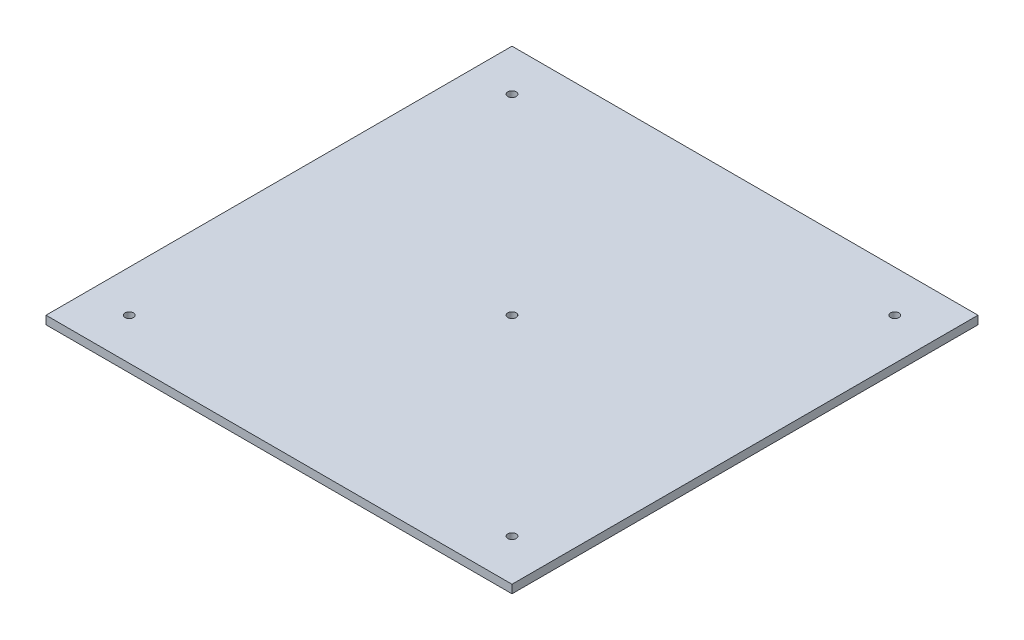
ISO-10303-21;
HEADER;
FILE_DESCRIPTION(('STEP AP214'),'2;1');
FILE_NAME('part.step','',(''),(''),'','','');
FILE_SCHEMA(('AUTOMOTIVE_DESIGN { 1 0 10303 214 1 1 1 1 }'));
ENDSEC;
DATA;
#1=APPLICATION_CONTEXT('core data for automotive mechanical design processes');
#2=APPLICATION_PROTOCOL_DEFINITION('international standard','automotive_design',2000,#1);
#3=PRODUCT_CONTEXT('',#1,'mechanical');
#4=PRODUCT('Part','Part','',(#3));
#5=PRODUCT_RELATED_PRODUCT_CATEGORY('part','',(#4));
#6=PRODUCT_DEFINITION_FORMATION('','',#4);
#7=PRODUCT_DEFINITION_CONTEXT('part definition',#1,'design');
#8=PRODUCT_DEFINITION('design','',#6,#7);
#9=PRODUCT_DEFINITION_SHAPE('','',#8);
#10=(LENGTH_UNIT() NAMED_UNIT(*) SI_UNIT(.MILLI.,.METRE.));
#11=(NAMED_UNIT(*) PLANE_ANGLE_UNIT() SI_UNIT($,.RADIAN.));
#12=(NAMED_UNIT(*) SI_UNIT($,.STERADIAN.) SOLID_ANGLE_UNIT());
#13=UNCERTAINTY_MEASURE_WITH_UNIT(LENGTH_MEASURE(1.E-05),#10,'distance_accuracy_value','');
#14=(GEOMETRIC_REPRESENTATION_CONTEXT(3) GLOBAL_UNCERTAINTY_ASSIGNED_CONTEXT((#13)) GLOBAL_UNIT_ASSIGNED_CONTEXT((#10,
#11,#12)) REPRESENTATION_CONTEXT('',''));
#15=CARTESIAN_POINT('',(0.,0.,0.));
#16=DIRECTION('',(0.,0.,1.));
#17=DIRECTION('',(1.,0.,0.));
#18=AXIS2_PLACEMENT_3D('',#15,#16,#17);
#19=CARTESIAN_POINT('',(0.,2.,0.));
#20=DIRECTION('',(0.,1.,0.));
#21=DIRECTION('',(0.,0.,1.));
#22=AXIS2_PLACEMENT_3D('',#19,#20,#21);
#23=PLANE('',#22);
#24=CARTESIAN_POINT('',(46.,2.,-46.));
#25=DIRECTION('',(0.,1.,0.));
#26=DIRECTION('',(0.,0.,-1.));
#27=AXIS2_PLACEMENT_3D('',#24,#25,#26);
#28=CIRCLE('',#27,0.999999999999998);
#29=CARTESIAN_POINT('',(46.,2.,-47.));
#30=VERTEX_POINT('',#29);
#31=EDGE_CURVE('E167',#30,#30,#28,.T.);
#32=ORIENTED_EDGE('',*,*,#31,.F.);
#33=EDGE_LOOP('',(#32));
#34=FACE_BOUND('',#33,.T.);
#35=CARTESIAN_POINT('',(-46.,2.,-46.));
#36=DIRECTION('',(0.,-1.,0.));
#37=DIRECTION('',(0.,0.,-1.));
#38=AXIS2_PLACEMENT_3D('',#35,#36,#37);
#39=CIRCLE('',#38,0.999999999999998);
#40=CARTESIAN_POINT('',(-46.,2.,-47.));
#41=VERTEX_POINT('',#40);
#42=EDGE_CURVE('E151',#41,#41,#39,.T.);
#43=ORIENTED_EDGE('',*,*,#42,.T.);
#44=EDGE_LOOP('',(#43));
#45=FACE_BOUND('',#44,.T.);
#46=CARTESIAN_POINT('',(-46.,2.,46.));
#47=DIRECTION('',(0.,1.,0.));
#48=DIRECTION('',(0.,0.,1.));
#49=AXIS2_PLACEMENT_3D('',#46,#47,#48);
#50=CIRCLE('',#49,0.999999999999998);
#51=CARTESIAN_POINT('',(-46.,2.,47.));
#52=VERTEX_POINT('',#51);
#53=EDGE_CURVE('E144',#52,#52,#50,.T.);
#54=ORIENTED_EDGE('',*,*,#53,.F.);
#55=EDGE_LOOP('',(#54));
#56=FACE_BOUND('',#55,.T.);
#57=CARTESIAN_POINT('',(0.,2.,0.));
#58=DIRECTION('',(0.,1.,0.));
#59=DIRECTION('',(0.,0.,1.));
#60=AXIS2_PLACEMENT_3D('',#57,#58,#59);
#61=CIRCLE('',#60,1.);
#62=CARTESIAN_POINT('',(0.,2.,1.));
#63=VERTEX_POINT('',#62);
#64=EDGE_CURVE('E139',#63,#63,#61,.T.);
#65=ORIENTED_EDGE('',*,*,#64,.F.);
#66=EDGE_LOOP('',(#65));
#67=FACE_BOUND('',#66,.T.);
#68=DIRECTION('',(0.,0.,1.));
#69=VECTOR('',#68,1.);
#70=CARTESIAN_POINT('',(-56.,2.,-56.));
#71=LINE('',#70,#69);
#72=CARTESIAN_POINT('',(-56.,2.,-56.));
#73=VERTEX_POINT('',#72);
#74=CARTESIAN_POINT('',(-56.,2.,56.));
#75=VERTEX_POINT('',#74);
#76=EDGE_CURVE('E97',#73,#75,#71,.T.);
#77=ORIENTED_EDGE('',*,*,#76,.T.);
#78=DIRECTION('',(1.,0.,0.));
#79=VECTOR('',#78,1.);
#80=CARTESIAN_POINT('',(-56.,2.,56.));
#81=LINE('',#80,#79);
#82=CARTESIAN_POINT('',(56.,2.,56.));
#83=VERTEX_POINT('',#82);
#84=EDGE_CURVE('E92',#75,#83,#81,.T.);
#85=ORIENTED_EDGE('',*,*,#84,.T.);
#86=DIRECTION('',(0.,0.,-1.));
#87=VECTOR('',#86,1.);
#88=CARTESIAN_POINT('',(56.,2.,-56.));
#89=LINE('',#88,#87);
#90=CARTESIAN_POINT('',(56.,2.,-56.));
#91=VERTEX_POINT('',#90);
#92=EDGE_CURVE('E95',#83,#91,#89,.T.);
#93=ORIENTED_EDGE('',*,*,#92,.T.);
#94=DIRECTION('',(-1.,0.,0.));
#95=VECTOR('',#94,1.);
#96=CARTESIAN_POINT('',(-56.,2.,-56.));
#97=LINE('',#96,#95);
#98=EDGE_CURVE('E62',#91,#73,#97,.T.);
#99=ORIENTED_EDGE('',*,*,#98,.T.);
#100=EDGE_LOOP('',(#77,#85,#93,#99));
#101=FACE_BOUND('',#100,.T.);
#102=CARTESIAN_POINT('',(46.,2.,46.));
#103=DIRECTION('',(0.,-1.,0.));
#104=DIRECTION('',(0.,0.,1.));
#105=AXIS2_PLACEMENT_3D('',#102,#103,#104);
#106=CIRCLE('',#105,0.999999999999998);
#107=CARTESIAN_POINT('',(46.,2.,47.));
#108=VERTEX_POINT('',#107);
#109=EDGE_CURVE('E159',#108,#108,#106,.T.);
#110=ORIENTED_EDGE('',*,*,#109,.T.);
#111=EDGE_LOOP('',(#110));
#112=FACE_BOUND('',#111,.T.);
#113=ADVANCED_FACE('F44',(#34,#45,#56,#67,#101,#112),#23,.T.);
#114=CARTESIAN_POINT('',(0.,0.,0.));
#115=DIRECTION('',(0.,1.,0.));
#116=DIRECTION('',(0.,0.,1.));
#117=AXIS2_PLACEMENT_3D('',#114,#115,#116);
#118=PLANE('',#117);
#119=CARTESIAN_POINT('',(46.,0.,-46.));
#120=DIRECTION('',(0.,1.,0.));
#121=DIRECTION('',(0.,0.,-1.));
#122=AXIS2_PLACEMENT_3D('',#119,#120,#121);
#123=CIRCLE('',#122,0.999999999999998);
#124=CARTESIAN_POINT('',(46.,0.,-47.));
#125=VERTEX_POINT('',#124);
#126=EDGE_CURVE('E163',#125,#125,#123,.T.);
#127=ORIENTED_EDGE('',*,*,#126,.T.);
#128=EDGE_LOOP('',(#127));
#129=FACE_BOUND('',#128,.T.);
#130=CARTESIAN_POINT('',(-46.,0.,46.));
#131=DIRECTION('',(0.,1.,0.));
#132=DIRECTION('',(0.,0.,1.));
#133=AXIS2_PLACEMENT_3D('',#130,#131,#132);
#134=CIRCLE('',#133,0.999999999999998);
#135=CARTESIAN_POINT('',(-46.,0.,47.));
#136=VERTEX_POINT('',#135);
#137=EDGE_CURVE('E117',#136,#136,#134,.T.);
#138=ORIENTED_EDGE('',*,*,#137,.T.);
#139=EDGE_LOOP('',(#138));
#140=FACE_BOUND('',#139,.T.);
#141=CARTESIAN_POINT('',(0.,0.,0.));
#142=DIRECTION('',(0.,1.,0.));
#143=DIRECTION('',(0.,0.,1.));
#144=AXIS2_PLACEMENT_3D('',#141,#142,#143);
#145=CIRCLE('',#144,1.);
#146=CARTESIAN_POINT('',(0.,0.,1.));
#147=VERTEX_POINT('',#146);
#148=EDGE_CURVE('E135',#147,#147,#145,.T.);
#149=ORIENTED_EDGE('',*,*,#148,.T.);
#150=EDGE_LOOP('',(#149));
#151=FACE_BOUND('',#150,.T.);
#152=DIRECTION('',(0.,0.,1.));
#153=VECTOR('',#152,1.);
#154=CARTESIAN_POINT('',(-56.,0.,-56.));
#155=LINE('',#154,#153);
#156=CARTESIAN_POINT('',(-56.,0.,-56.));
#157=VERTEX_POINT('',#156);
#158=CARTESIAN_POINT('',(-56.,0.,56.));
#159=VERTEX_POINT('',#158);
#160=EDGE_CURVE('E113',#157,#159,#155,.T.);
#161=ORIENTED_EDGE('',*,*,#160,.F.);
#162=DIRECTION('',(-1.,0.,0.));
#163=VECTOR('',#162,1.);
#164=CARTESIAN_POINT('',(-56.,0.,-56.));
#165=LINE('',#164,#163);
#166=CARTESIAN_POINT('',(56.,0.,-56.));
#167=VERTEX_POINT('',#166);
#168=EDGE_CURVE('E85',#167,#157,#165,.T.);
#169=ORIENTED_EDGE('',*,*,#168,.F.);
#170=DIRECTION('',(0.,0.,-1.));
#171=VECTOR('',#170,1.);
#172=CARTESIAN_POINT('',(56.,0.,-56.));
#173=LINE('',#172,#171);
#174=CARTESIAN_POINT('',(56.,0.,56.));
#175=VERTEX_POINT('',#174);
#176=EDGE_CURVE('E79',#175,#167,#173,.T.);
#177=ORIENTED_EDGE('',*,*,#176,.F.);
#178=DIRECTION('',(1.,0.,0.));
#179=VECTOR('',#178,1.);
#180=CARTESIAN_POINT('',(-56.,0.,56.));
#181=LINE('',#180,#179);
#182=EDGE_CURVE('E102',#159,#175,#181,.T.);
#183=ORIENTED_EDGE('',*,*,#182,.F.);
#184=EDGE_LOOP('',(#161,#169,#177,#183));
#185=FACE_BOUND('',#184,.T.);
#186=CARTESIAN_POINT('',(-46.,0.,-46.));
#187=DIRECTION('',(0.,-1.,0.));
#188=DIRECTION('',(0.,0.,-1.));
#189=AXIS2_PLACEMENT_3D('',#186,#187,#188);
#190=CIRCLE('',#189,0.999999999999998);
#191=CARTESIAN_POINT('',(-46.,0.,-47.));
#192=VERTEX_POINT('',#191);
#193=EDGE_CURVE('E140',#192,#192,#190,.T.);
#194=ORIENTED_EDGE('',*,*,#193,.F.);
#195=EDGE_LOOP('',(#194));
#196=FACE_BOUND('',#195,.T.);
#197=CARTESIAN_POINT('',(46.,0.,46.));
#198=DIRECTION('',(0.,-1.,0.));
#199=DIRECTION('',(0.,0.,1.));
#200=AXIS2_PLACEMENT_3D('',#197,#198,#199);
#201=CIRCLE('',#200,0.999999999999998);
#202=CARTESIAN_POINT('',(46.,0.,47.));
#203=VERTEX_POINT('',#202);
#204=EDGE_CURVE('E155',#203,#203,#201,.T.);
#205=ORIENTED_EDGE('',*,*,#204,.F.);
#206=EDGE_LOOP('',(#205));
#207=FACE_BOUND('',#206,.T.);
#208=ADVANCED_FACE('F130',(#129,#140,#151,#185,#196,#207),#118,.F.);
#209=CARTESIAN_POINT('',(-56.,2.,-56.));
#210=DIRECTION('',(1.,0.,0.));
#211=DIRECTION('',(0.,0.,-1.));
#212=AXIS2_PLACEMENT_3D('',#209,#210,#211);
#213=PLANE('',#212);
#214=ORIENTED_EDGE('',*,*,#160,.T.);
#215=DIRECTION('',(0.,-1.,0.));
#216=VECTOR('',#215,1.);
#217=CARTESIAN_POINT('',(-56.,2.,56.));
#218=LINE('',#217,#216);
#219=EDGE_CURVE('E11',#75,#159,#218,.T.);
#220=ORIENTED_EDGE('',*,*,#219,.F.);
#221=ORIENTED_EDGE('',*,*,#76,.F.);
#222=DIRECTION('',(0.,-1.,0.));
#223=VECTOR('',#222,1.);
#224=CARTESIAN_POINT('',(-56.,2.,-56.));
#225=LINE('',#224,#223);
#226=EDGE_CURVE('E109',#73,#157,#225,.T.);
#227=ORIENTED_EDGE('',*,*,#226,.T.);
#228=EDGE_LOOP('',(#214,#220,#221,#227));
#229=FACE_BOUND('',#228,.T.);
#230=ADVANCED_FACE('F46',(#229),#213,.F.);
#231=CARTESIAN_POINT('',(-56.,2.,56.));
#232=DIRECTION('',(0.,0.,-1.));
#233=DIRECTION('',(-1.,0.,0.));
#234=AXIS2_PLACEMENT_3D('',#231,#232,#233);
#235=PLANE('',#234);
#236=ORIENTED_EDGE('',*,*,#182,.T.);
#237=DIRECTION('',(0.,-1.,0.));
#238=VECTOR('',#237,1.);
#239=CARTESIAN_POINT('',(56.,2.,56.));
#240=LINE('',#239,#238);
#241=EDGE_CURVE('E54',#83,#175,#240,.T.);
#242=ORIENTED_EDGE('',*,*,#241,.F.);
#243=ORIENTED_EDGE('',*,*,#84,.F.);
#244=ORIENTED_EDGE('',*,*,#219,.T.);
#245=EDGE_LOOP('',(#236,#242,#243,#244));
#246=FACE_BOUND('',#245,.T.);
#247=ADVANCED_FACE('F101',(#246),#235,.F.);
#248=CARTESIAN_POINT('',(56.,2.,-56.));
#249=DIRECTION('',(-1.,0.,0.));
#250=DIRECTION('',(0.,0.,1.));
#251=AXIS2_PLACEMENT_3D('',#248,#249,#250);
#252=PLANE('',#251);
#253=ORIENTED_EDGE('',*,*,#176,.T.);
#254=DIRECTION('',(0.,-1.,0.));
#255=VECTOR('',#254,1.);
#256=CARTESIAN_POINT('',(56.,2.,-56.));
#257=LINE('',#256,#255);
#258=EDGE_CURVE('E104',#91,#167,#257,.T.);
#259=ORIENTED_EDGE('',*,*,#258,.F.);
#260=ORIENTED_EDGE('',*,*,#92,.F.);
#261=ORIENTED_EDGE('',*,*,#241,.T.);
#262=EDGE_LOOP('',(#253,#259,#260,#261));
#263=FACE_BOUND('',#262,.T.);
#264=ADVANCED_FACE('F105',(#263),#252,.F.);
#265=CARTESIAN_POINT('',(-56.,2.,-56.));
#266=DIRECTION('',(0.,0.,1.));
#267=DIRECTION('',(1.,0.,0.));
#268=AXIS2_PLACEMENT_3D('',#265,#266,#267);
#269=PLANE('',#268);
#270=ORIENTED_EDGE('',*,*,#168,.T.);
#271=ORIENTED_EDGE('',*,*,#226,.F.);
#272=ORIENTED_EDGE('',*,*,#98,.F.);
#273=ORIENTED_EDGE('',*,*,#258,.T.);
#274=EDGE_LOOP('',(#270,#271,#272,#273));
#275=FACE_BOUND('',#274,.T.);
#276=ADVANCED_FACE('F127',(#275),#269,.F.);
#277=CARTESIAN_POINT('',(0.,0.,0.));
#278=DIRECTION('',(0.,1.,0.));
#279=DIRECTION('',(0.,0.,1.));
#280=AXIS2_PLACEMENT_3D('',#277,#278,#279);
#281=CYLINDRICAL_SURFACE('',#280,1.);
#282=ORIENTED_EDGE('',*,*,#148,.F.);
#283=EDGE_LOOP('',(#282));
#284=FACE_BOUND('',#283,.T.);
#285=ORIENTED_EDGE('',*,*,#64,.T.);
#286=EDGE_LOOP('',(#285));
#287=FACE_BOUND('',#286,.T.);
#288=ADVANCED_FACE('F193',(#284,#287),#281,.F.);
#289=CARTESIAN_POINT('',(-46.,0.,46.));
#290=DIRECTION('',(0.,1.,0.));
#291=DIRECTION('',(0.,0.,1.));
#292=AXIS2_PLACEMENT_3D('',#289,#290,#291);
#293=CYLINDRICAL_SURFACE('',#292,0.999999999999998);
#294=ORIENTED_EDGE('',*,*,#137,.F.);
#295=EDGE_LOOP('',(#294));
#296=FACE_BOUND('',#295,.T.);
#297=ORIENTED_EDGE('',*,*,#53,.T.);
#298=EDGE_LOOP('',(#297));
#299=FACE_BOUND('',#298,.T.);
#300=ADVANCED_FACE('F195',(#296,#299),#293,.F.);
#301=CARTESIAN_POINT('',(-46.,0.,-46.));
#302=DIRECTION('',(0.,1.,0.));
#303=DIRECTION('',(0.,0.,1.));
#304=AXIS2_PLACEMENT_3D('',#301,#302,#303);
#305=CYLINDRICAL_SURFACE('',#304,0.999999999999998);
#306=ORIENTED_EDGE('',*,*,#193,.T.);
#307=EDGE_LOOP('',(#306));
#308=FACE_BOUND('',#307,.T.);
#309=ORIENTED_EDGE('',*,*,#42,.F.);
#310=EDGE_LOOP('',(#309));
#311=FACE_BOUND('',#310,.T.);
#312=ADVANCED_FACE('F202',(#308,#311),#305,.F.);
#313=CARTESIAN_POINT('',(46.,0.,46.));
#314=DIRECTION('',(0.,1.,0.));
#315=DIRECTION('',(0.,0.,1.));
#316=AXIS2_PLACEMENT_3D('',#313,#314,#315);
#317=CYLINDRICAL_SURFACE('',#316,0.999999999999998);
#318=ORIENTED_EDGE('',*,*,#204,.T.);
#319=EDGE_LOOP('',(#318));
#320=FACE_BOUND('',#319,.T.);
#321=ORIENTED_EDGE('',*,*,#109,.F.);
#322=EDGE_LOOP('',(#321));
#323=FACE_BOUND('',#322,.T.);
#324=ADVANCED_FACE('F180',(#320,#323),#317,.F.);
#325=CARTESIAN_POINT('',(46.,0.,-46.));
#326=DIRECTION('',(0.,1.,0.));
#327=DIRECTION('',(0.,0.,1.));
#328=AXIS2_PLACEMENT_3D('',#325,#326,#327);
#329=CYLINDRICAL_SURFACE('',#328,0.999999999999998);
#330=ORIENTED_EDGE('',*,*,#126,.F.);
#331=EDGE_LOOP('',(#330));
#332=FACE_BOUND('',#331,.T.);
#333=ORIENTED_EDGE('',*,*,#31,.T.);
#334=EDGE_LOOP('',(#333));
#335=FACE_BOUND('',#334,.T.);
#336=ADVANCED_FACE('F177',(#332,#335),#329,.F.);
#337=CLOSED_SHELL('',(#113,#208,#230,#247,#264,#276,#288,#300,#312,#324,#336));
#338=MANIFOLD_SOLID_BREP('B2',#337);
#339=ADVANCED_BREP_SHAPE_REPRESENTATION('',(#18,#338),#14);
#340=SHAPE_DEFINITION_REPRESENTATION(#9,#339);
ENDSEC;
END-ISO-10303-21;
